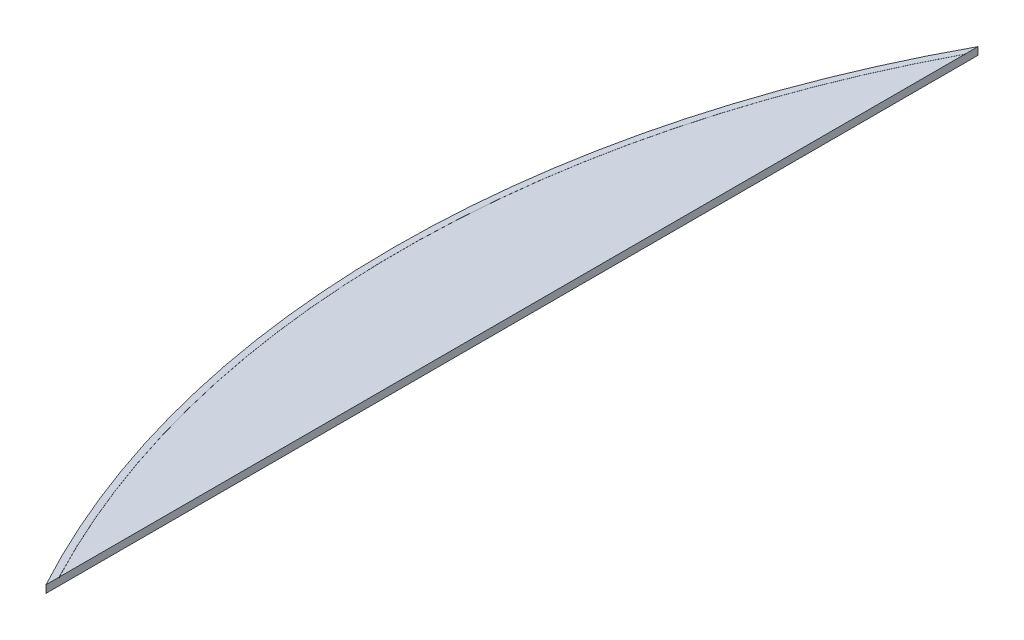
ISO-10303-21;
HEADER;
FILE_DESCRIPTION(('STEP AP214'),'2;1');
FILE_NAME('part.step','',(''),(''),'','','');
FILE_SCHEMA(('AUTOMOTIVE_DESIGN { 1 0 10303 214 1 1 1 1 }'));
ENDSEC;
DATA;
#1=APPLICATION_CONTEXT('core data for automotive mechanical design processes');
#2=APPLICATION_PROTOCOL_DEFINITION('international standard','automotive_design',2000,#1);
#3=PRODUCT_CONTEXT('',#1,'mechanical');
#4=PRODUCT('Part','Part','',(#3));
#5=PRODUCT_RELATED_PRODUCT_CATEGORY('part','',(#4));
#6=PRODUCT_DEFINITION_FORMATION('','',#4);
#7=PRODUCT_DEFINITION_CONTEXT('part definition',#1,'design');
#8=PRODUCT_DEFINITION('design','',#6,#7);
#9=PRODUCT_DEFINITION_SHAPE('','',#8);
#10=(LENGTH_UNIT() NAMED_UNIT(*) SI_UNIT(.MILLI.,.METRE.));
#11=(NAMED_UNIT(*) PLANE_ANGLE_UNIT() SI_UNIT($,.RADIAN.));
#12=(NAMED_UNIT(*) SI_UNIT($,.STERADIAN.) SOLID_ANGLE_UNIT());
#13=UNCERTAINTY_MEASURE_WITH_UNIT(LENGTH_MEASURE(1.E-05),#10,'distance_accuracy_value','');
#14=(GEOMETRIC_REPRESENTATION_CONTEXT(3) GLOBAL_UNCERTAINTY_ASSIGNED_CONTEXT((#13)) GLOBAL_UNIT_ASSIGNED_CONTEXT((#10,
#11,#12)) REPRESENTATION_CONTEXT('',''));
#15=CARTESIAN_POINT('',(0.,0.,0.));
#16=DIRECTION('',(0.,0.,1.));
#17=DIRECTION('',(1.,0.,0.));
#18=AXIS2_PLACEMENT_3D('',#15,#16,#17);
#19=CARTESIAN_POINT('',(0.,421.,0.));
#20=DIRECTION('',(0.,1.,0.));
#21=DIRECTION('',(0.,0.,1.));
#22=AXIS2_PLACEMENT_3D('',#19,#20,#21);
#23=PLANE('',#22);
#24=CARTESIAN_POINT('',(0.,421.,0.));
#25=DIRECTION('',(0.,1.,0.));
#26=DIRECTION('',(0.,0.,1.));
#27=AXIS2_PLACEMENT_3D('',#24,#25,#26);
#28=CIRCLE('',#27,772.);
#29=CARTESIAN_POINT('',(-683.,421.,359.854137116693));
#30=VERTEX_POINT('',#29);
#31=CARTESIAN_POINT('',(-683.,421.,-359.854137116693));
#32=VERTEX_POINT('',#31);
#33=EDGE_CURVE('E121',#30,#32,#28,.F.);
#34=ORIENTED_EDGE('',*,*,#33,.F.);
#35=DIRECTION('',(0.,0.,-1.));
#36=VECTOR('',#35,1.);
#37=CARTESIAN_POINT('',(-683.,421.,-370.459174538842));
#38=LINE('',#37,#36);
#39=EDGE_CURVE('E91',#30,#32,#38,.T.);
#40=ORIENTED_EDGE('',*,*,#39,.T.);
#41=EDGE_LOOP('',(#34,#40));
#42=FACE_BOUND('',#41,.T.);
#43=ADVANCED_FACE('F43',(#42),#23,.T.);
#44=CARTESIAN_POINT('',(0.,415.,0.));
#45=DIRECTION('',(0.,1.,0.));
#46=DIRECTION('',(0.,0.,1.));
#47=AXIS2_PLACEMENT_3D('',#44,#45,#46);
#48=CYLINDRICAL_SURFACE('',#47,777.);
#49=CARTESIAN_POINT('',(0.,421.,0.));
#50=DIRECTION('',(0.,1.,0.));
#51=DIRECTION('',(0.,0.,1.));
#52=AXIS2_PLACEMENT_3D('',#49,#50,#51);
#53=CIRCLE('',#52,777.);
#54=CARTESIAN_POINT('',(-683.,421.,-370.459174538842));
#55=VERTEX_POINT('',#54);
#56=CARTESIAN_POINT('',(-683.,421.,370.459174538842));
#57=VERTEX_POINT('',#56);
#58=EDGE_CURVE('E86',#55,#57,#53,.T.);
#59=ORIENTED_EDGE('',*,*,#58,.F.);
#60=DIRECTION('',(0.,1.,0.));
#61=VECTOR('',#60,1.);
#62=CARTESIAN_POINT('',(-683.,415.,-370.459174538842));
#63=LINE('',#62,#61);
#64=CARTESIAN_POINT('',(-683.,415.,-370.459174538842));
#65=VERTEX_POINT('',#64);
#66=EDGE_CURVE('E69',#65,#55,#63,.T.);
#67=ORIENTED_EDGE('',*,*,#66,.F.);
#68=CARTESIAN_POINT('',(0.,415.,0.));
#69=DIRECTION('',(0.,1.,0.));
#70=DIRECTION('',(0.,0.,1.));
#71=AXIS2_PLACEMENT_3D('',#68,#69,#70);
#72=CIRCLE('',#71,777.);
#73=CARTESIAN_POINT('',(-683.,415.,370.459174538842));
#74=VERTEX_POINT('',#73);
#75=EDGE_CURVE('E159',#65,#74,#72,.T.);
#76=ORIENTED_EDGE('',*,*,#75,.T.);
#77=DIRECTION('',(0.,1.,0.));
#78=VECTOR('',#77,1.);
#79=CARTESIAN_POINT('',(-683.,415.,370.459174538842));
#80=LINE('',#79,#78);
#81=EDGE_CURVE('E99',#74,#57,#80,.T.);
#82=ORIENTED_EDGE('',*,*,#81,.T.);
#83=EDGE_LOOP('',(#59,#67,#76,#82));
#84=FACE_BOUND('',#83,.T.);
#85=ADVANCED_FACE('F45',(#84),#48,.T.);
#86=CARTESIAN_POINT('',(-683.,415.,-370.459174538842));
#87=DIRECTION('',(1.,0.,0.));
#88=DIRECTION('',(0.,0.,-1.));
#89=AXIS2_PLACEMENT_3D('',#86,#87,#88);
#90=PLANE('',#89);
#91=DIRECTION('',(0.,1.,0.));
#92=VECTOR('',#91,1.);
#93=CARTESIAN_POINT('',(-683.,420.5,359.854137116693));
#94=LINE('',#93,#92);
#95=CARTESIAN_POINT('',(-683.,420.5,359.854137116693));
#96=VERTEX_POINT('',#95);
#97=EDGE_CURVE('E107',#96,#30,#94,.T.);
#98=ORIENTED_EDGE('',*,*,#97,.F.);
#99=DIRECTION('',(0.,0.,-1.));
#100=VECTOR('',#99,1.);
#101=CARTESIAN_POINT('',(-683.,420.5,-370.459174538842));
#102=LINE('',#101,#100);
#103=CARTESIAN_POINT('',(-683.,420.5,360.055742588966));
#104=VERTEX_POINT('',#103);
#105=EDGE_CURVE('E12',#104,#96,#102,.T.);
#106=ORIENTED_EDGE('',*,*,#105,.F.);
#107=DIRECTION('',(0.,1.,0.));
#108=VECTOR('',#107,1.);
#109=CARTESIAN_POINT('',(-683.,420.5,360.055742588966));
#110=LINE('',#109,#108);
#111=CARTESIAN_POINT('',(-683.,421.,360.055742588966));
#112=VERTEX_POINT('',#111);
#113=EDGE_CURVE('E150',#112,#104,#110,.F.);
#114=ORIENTED_EDGE('',*,*,#113,.F.);
#115=EDGE_CURVE('E92',#57,#112,#38,.T.);
#116=ORIENTED_EDGE('',*,*,#115,.F.);
#117=ORIENTED_EDGE('',*,*,#81,.F.);
#118=DIRECTION('',(0.,0.,-1.));
#119=VECTOR('',#118,1.);
#120=CARTESIAN_POINT('',(-683.,415.,-370.459174538842));
#121=LINE('',#120,#119);
#122=EDGE_CURVE('E97',#74,#65,#121,.T.);
#123=ORIENTED_EDGE('',*,*,#122,.T.);
#124=ORIENTED_EDGE('',*,*,#66,.T.);
#125=CARTESIAN_POINT('',(-683.,421.,-360.055742588966));
#126=VERTEX_POINT('',#125);
#127=EDGE_CURVE('E83',#126,#55,#38,.T.);
#128=ORIENTED_EDGE('',*,*,#127,.F.);
#129=DIRECTION('',(0.,1.,0.));
#130=VECTOR('',#129,1.);
#131=CARTESIAN_POINT('',(-683.,420.5,-360.055742588966));
#132=LINE('',#131,#130);
#133=CARTESIAN_POINT('',(-683.,420.5,-360.055742588966));
#134=VERTEX_POINT('',#133);
#135=EDGE_CURVE('E60',#134,#126,#132,.T.);
#136=ORIENTED_EDGE('',*,*,#135,.F.);
#137=CARTESIAN_POINT('',(-683.,420.5,-359.854137116693));
#138=VERTEX_POINT('',#137);
#139=EDGE_CURVE('E47',#138,#134,#102,.T.);
#140=ORIENTED_EDGE('',*,*,#139,.F.);
#141=DIRECTION('',(0.,1.,0.));
#142=VECTOR('',#141,1.);
#143=CARTESIAN_POINT('',(-683.,420.5,-359.854137116693));
#144=LINE('',#143,#142);
#145=EDGE_CURVE('E102',#32,#138,#144,.F.);
#146=ORIENTED_EDGE('',*,*,#145,.F.);
#147=ORIENTED_EDGE('',*,*,#39,.F.);
#148=EDGE_LOOP('',(#98,#106,#114,#116,#117,#123,#124,#128,#136,#140,#146,#147));
#149=FACE_BOUND('',#148,.T.);
#150=ADVANCED_FACE('F95',(#149),#90,.T.);
#151=CARTESIAN_POINT('',(0.,415.,0.));
#152=DIRECTION('',(0.,1.,0.));
#153=DIRECTION('',(0.,0.,1.));
#154=AXIS2_PLACEMENT_3D('',#151,#152,#153);
#155=PLANE('',#154);
#156=ORIENTED_EDGE('',*,*,#75,.F.);
#157=ORIENTED_EDGE('',*,*,#122,.F.);
#158=EDGE_LOOP('',(#156,#157));
#159=FACE_BOUND('',#158,.T.);
#160=ADVANCED_FACE('F194',(#159),#155,.F.);
#161=CARTESIAN_POINT('',(0.,421.,0.));
#162=DIRECTION('',(0.,1.,0.));
#163=DIRECTION('',(0.,0.,1.));
#164=AXIS2_PLACEMENT_3D('',#161,#162,#163);
#165=CIRCLE('',#164,772.093995424969);
#166=EDGE_CURVE('E88',#126,#112,#165,.T.);
#167=ORIENTED_EDGE('',*,*,#166,.F.);
#168=ORIENTED_EDGE('',*,*,#127,.T.);
#169=ORIENTED_EDGE('',*,*,#58,.T.);
#170=ORIENTED_EDGE('',*,*,#115,.T.);
#171=EDGE_LOOP('',(#167,#168,#169,#170));
#172=FACE_BOUND('',#171,.T.);
#173=ADVANCED_FACE('F84',(#172),#23,.T.);
#174=CARTESIAN_POINT('',(0.,420.5,0.));
#175=DIRECTION('',(0.,1.,0.));
#176=DIRECTION('',(0.,0.,1.));
#177=AXIS2_PLACEMENT_3D('',#174,#175,#176);
#178=CYLINDRICAL_SURFACE('',#177,772.);
#179=ORIENTED_EDGE('',*,*,#145,.T.);
#180=CARTESIAN_POINT('',(0.,420.5,0.));
#181=DIRECTION('',(0.,-1.,0.));
#182=DIRECTION('',(0.,0.,-1.));
#183=AXIS2_PLACEMENT_3D('',#180,#181,#182);
#184=CIRCLE('',#183,772.);
#185=EDGE_CURVE('E144',#96,#138,#184,.T.);
#186=ORIENTED_EDGE('',*,*,#185,.F.);
#187=ORIENTED_EDGE('',*,*,#97,.T.);
#188=ORIENTED_EDGE('',*,*,#33,.T.);
#189=EDGE_LOOP('',(#179,#186,#187,#188));
#190=FACE_BOUND('',#189,.T.);
#191=ADVANCED_FACE('F177',(#190),#178,.T.);
#192=CARTESIAN_POINT('',(0.,420.5,0.));
#193=DIRECTION('',(0.,1.,0.));
#194=DIRECTION('',(0.,0.,1.));
#195=AXIS2_PLACEMENT_3D('',#192,#193,#194);
#196=CYLINDRICAL_SURFACE('',#195,772.093995424969);
#197=ORIENTED_EDGE('',*,*,#135,.T.);
#198=ORIENTED_EDGE('',*,*,#166,.T.);
#199=ORIENTED_EDGE('',*,*,#113,.T.);
#200=CARTESIAN_POINT('',(0.,420.5,0.));
#201=DIRECTION('',(0.,1.,0.));
#202=DIRECTION('',(0.,0.,-1.));
#203=AXIS2_PLACEMENT_3D('',#200,#201,#202);
#204=CIRCLE('',#203,772.093995424969);
#205=EDGE_CURVE('E141',#134,#104,#204,.T.);
#206=ORIENTED_EDGE('',*,*,#205,.F.);
#207=EDGE_LOOP('',(#197,#198,#199,#206));
#208=FACE_BOUND('',#207,.T.);
#209=ADVANCED_FACE('F148',(#208),#196,.F.);
#210=CARTESIAN_POINT('',(0.,420.5,0.));
#211=DIRECTION('',(0.,-1.,0.));
#212=DIRECTION('',(0.,0.,-1.));
#213=AXIS2_PLACEMENT_3D('',#210,#211,#212);
#214=PLANE('',#213);
#215=ORIENTED_EDGE('',*,*,#105,.T.);
#216=ORIENTED_EDGE('',*,*,#185,.T.);
#217=ORIENTED_EDGE('',*,*,#139,.T.);
#218=ORIENTED_EDGE('',*,*,#205,.T.);
#219=EDGE_LOOP('',(#215,#216,#217,#218));
#220=FACE_BOUND('',#219,.T.);
#221=ADVANCED_FACE('F139',(#220),#214,.F.);
#222=CLOSED_SHELL('',(#43,#85,#150,#160,#173,#191,#209,#221));
#223=MANIFOLD_SOLID_BREP('B2',#222);
#224=ADVANCED_BREP_SHAPE_REPRESENTATION('',(#18,#223),#14);
#225=SHAPE_DEFINITION_REPRESENTATION(#9,#224);
ENDSEC;
END-ISO-10303-21;
